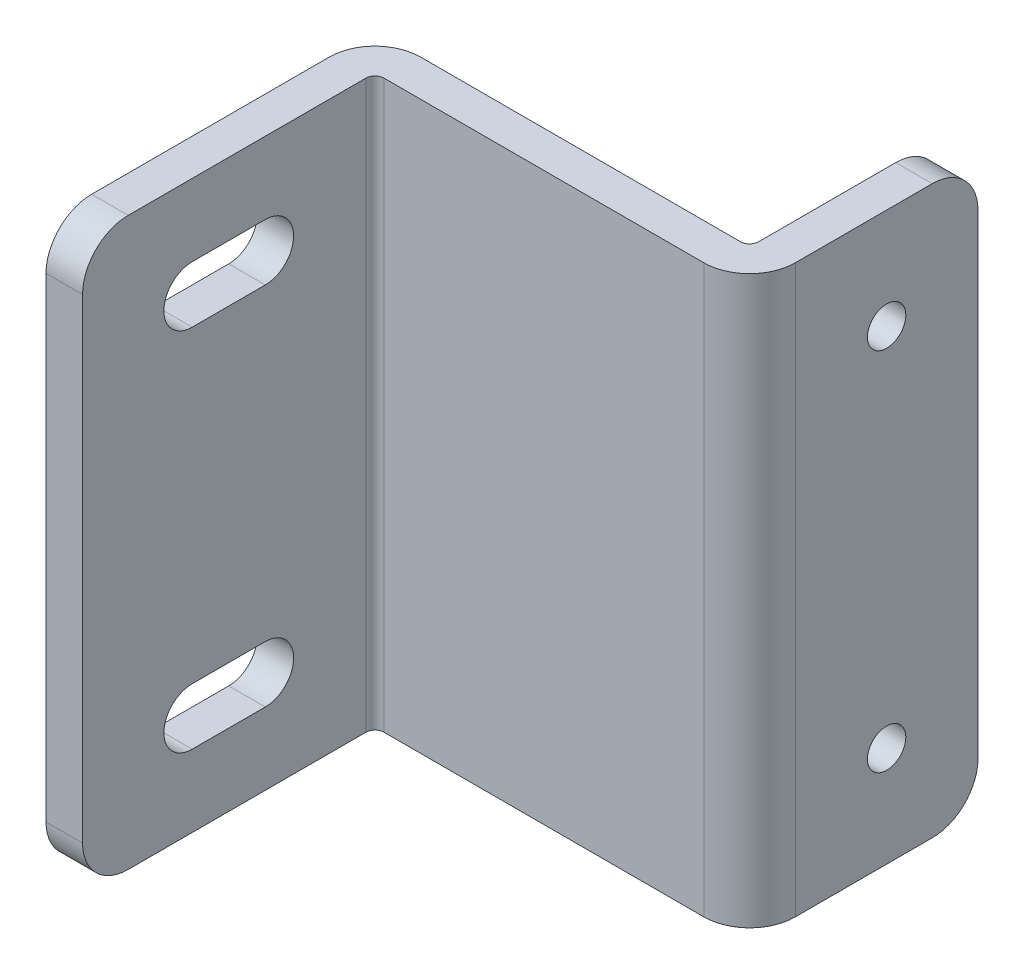
ISO-10303-21;
HEADER;
FILE_DESCRIPTION(('STEP AP214'),'2;1');
FILE_NAME('part.step','',(''),(''),'','','');
FILE_SCHEMA(('AUTOMOTIVE_DESIGN { 1 0 10303 214 1 1 1 1 }'));
ENDSEC;
DATA;
#1=APPLICATION_CONTEXT('core data for automotive mechanical design processes');
#2=APPLICATION_PROTOCOL_DEFINITION('international standard','automotive_design',2000,#1);
#3=PRODUCT_CONTEXT('',#1,'mechanical');
#4=PRODUCT('Part','Part','',(#3));
#5=PRODUCT_RELATED_PRODUCT_CATEGORY('part','',(#4));
#6=PRODUCT_DEFINITION_FORMATION('','',#4);
#7=PRODUCT_DEFINITION_CONTEXT('part definition',#1,'design');
#8=PRODUCT_DEFINITION('design','',#6,#7);
#9=PRODUCT_DEFINITION_SHAPE('','',#8);
#10=(LENGTH_UNIT() NAMED_UNIT(*) SI_UNIT(.MILLI.,.METRE.));
#11=(NAMED_UNIT(*) PLANE_ANGLE_UNIT() SI_UNIT($,.RADIAN.));
#12=(NAMED_UNIT(*) SI_UNIT($,.STERADIAN.) SOLID_ANGLE_UNIT());
#13=UNCERTAINTY_MEASURE_WITH_UNIT(LENGTH_MEASURE(1.E-05),#10,'distance_accuracy_value','');
#14=(GEOMETRIC_REPRESENTATION_CONTEXT(3) GLOBAL_UNCERTAINTY_ASSIGNED_CONTEXT((#13)) GLOBAL_UNIT_ASSIGNED_CONTEXT((#10,
#11,#12)) REPRESENTATION_CONTEXT('',''));
#15=CARTESIAN_POINT('',(0.,0.,0.));
#16=DIRECTION('',(0.,0.,1.));
#17=DIRECTION('',(1.,0.,0.));
#18=AXIS2_PLACEMENT_3D('',#15,#16,#17);
#19=CARTESIAN_POINT('',(4.00000000000007,62.,-21.));
#20=DIRECTION('',(0.,0.,1.));
#21=DIRECTION('',(1.,0.,0.));
#22=AXIS2_PLACEMENT_3D('',#19,#20,#21);
#23=PLANE('',#22);
#24=DIRECTION('',(0.,1.,0.));
#25=VECTOR('',#24,1.);
#26=CARTESIAN_POINT('',(4.00000000000007,0.,-21.));
#27=LINE('',#26,#25);
#28=CARTESIAN_POINT('',(4.00000000000007,5.,-21.));
#29=VERTEX_POINT('',#28);
#30=CARTESIAN_POINT('',(4.00000000000007,57.,-21.));
#31=VERTEX_POINT('',#30);
#32=EDGE_CURVE('E300',#29,#31,#27,.T.);
#33=ORIENTED_EDGE('',*,*,#32,.F.);
#34=DIRECTION('',(-1.,0.,0.));
#35=VECTOR('',#34,1.);
#36=CARTESIAN_POINT('',(4.00000000000007,5.,-21.));
#37=LINE('',#36,#35);
#38=CARTESIAN_POINT('',(0.,5.,-21.));
#39=VERTEX_POINT('',#38);
#40=EDGE_CURVE('E336',#39,#29,#37,.F.);
#41=ORIENTED_EDGE('',*,*,#40,.F.);
#42=DIRECTION('',(0.,1.,0.));
#43=VECTOR('',#42,1.);
#44=CARTESIAN_POINT('',(0.,0.,-21.));
#45=LINE('',#44,#43);
#46=CARTESIAN_POINT('',(0.,57.,-21.));
#47=VERTEX_POINT('',#46);
#48=EDGE_CURVE('E293',#39,#47,#45,.T.);
#49=ORIENTED_EDGE('',*,*,#48,.T.);
#50=DIRECTION('',(-1.,0.,0.));
#51=VECTOR('',#50,1.);
#52=CARTESIAN_POINT('',(4.00000000000007,57.,-21.));
#53=LINE('',#52,#51);
#54=EDGE_CURVE('E333',#31,#47,#53,.T.);
#55=ORIENTED_EDGE('',*,*,#54,.F.);
#56=EDGE_LOOP('',(#33,#41,#49,#55));
#57=FACE_BOUND('',#56,.T.);
#58=ADVANCED_FACE('F17',(#57),#23,.F.);
#59=CARTESIAN_POINT('',(-6.,11.,-11.));
#60=DIRECTION('',(1.,0.,0.));
#61=DIRECTION('',(0.,0.,-1.));
#62=AXIS2_PLACEMENT_3D('',#59,#60,#61);
#63=CYLINDRICAL_SURFACE('',#62,2.1);
#64=CARTESIAN_POINT('',(0.,11.,-11.));
#65=DIRECTION('',(1.,0.,0.));
#66=DIRECTION('',(0.,0.,-1.));
#67=AXIS2_PLACEMENT_3D('',#64,#65,#66);
#68=CIRCLE('',#67,2.1);
#69=CARTESIAN_POINT('',(0.,11.,-13.1));
#70=VERTEX_POINT('',#69);
#71=EDGE_CURVE('E366',#70,#70,#68,.F.);
#72=ORIENTED_EDGE('',*,*,#71,.T.);
#73=EDGE_LOOP('',(#72));
#74=FACE_BOUND('',#73,.T.);
#75=CARTESIAN_POINT('',(4.,11.,-11.));
#76=DIRECTION('',(1.,0.,0.));
#77=DIRECTION('',(0.,0.,-1.));
#78=AXIS2_PLACEMENT_3D('',#75,#76,#77);
#79=CIRCLE('',#78,2.1);
#80=CARTESIAN_POINT('',(4.00000000000001,11.,-13.1));
#81=VERTEX_POINT('',#80);
#82=EDGE_CURVE('E306',#81,#81,#79,.F.);
#83=ORIENTED_EDGE('',*,*,#82,.F.);
#84=EDGE_LOOP('',(#83));
#85=FACE_BOUND('',#84,.T.);
#86=ADVANCED_FACE('F502',(#74,#85),#63,.F.);
#87=CARTESIAN_POINT('',(-6.,51.,-11.));
#88=DIRECTION('',(1.,0.,0.));
#89=DIRECTION('',(0.,0.,-1.));
#90=AXIS2_PLACEMENT_3D('',#87,#88,#89);
#91=CYLINDRICAL_SURFACE('',#90,2.1);
#92=CARTESIAN_POINT('',(0.,51.,-11.));
#93=DIRECTION('',(1.,0.,0.));
#94=DIRECTION('',(0.,0.,-1.));
#95=AXIS2_PLACEMENT_3D('',#92,#93,#94);
#96=CIRCLE('',#95,2.1);
#97=CARTESIAN_POINT('',(0.,51.,-13.1));
#98=VERTEX_POINT('',#97);
#99=EDGE_CURVE('E289',#98,#98,#96,.F.);
#100=ORIENTED_EDGE('',*,*,#99,.T.);
#101=EDGE_LOOP('',(#100));
#102=FACE_BOUND('',#101,.T.);
#103=CARTESIAN_POINT('',(4.,51.,-11.));
#104=DIRECTION('',(1.,0.,0.));
#105=DIRECTION('',(0.,0.,-1.));
#106=AXIS2_PLACEMENT_3D('',#103,#104,#105);
#107=CIRCLE('',#106,2.1);
#108=CARTESIAN_POINT('',(4.00000000000001,51.,-13.1));
#109=VERTEX_POINT('',#108);
#110=EDGE_CURVE('E339',#109,#109,#107,.F.);
#111=ORIENTED_EDGE('',*,*,#110,.F.);
#112=EDGE_LOOP('',(#111));
#113=FACE_BOUND('',#112,.T.);
#114=ADVANCED_FACE('F500',(#102,#113),#91,.F.);
#115=CARTESIAN_POINT('',(-41.,62.,36.));
#116=DIRECTION('',(0.,0.,-1.));
#117=DIRECTION('',(-1.,0.,0.));
#118=AXIS2_PLACEMENT_3D('',#115,#116,#117);
#119=PLANE('',#118);
#120=DIRECTION('',(0.,1.,0.));
#121=VECTOR('',#120,1.);
#122=CARTESIAN_POINT('',(-41.,62.,36.));
#123=LINE('',#122,#121);
#124=CARTESIAN_POINT('',(-41.,5.,36.));
#125=VERTEX_POINT('',#124);
#126=CARTESIAN_POINT('',(-41.,57.,36.));
#127=VERTEX_POINT('',#126);
#128=EDGE_CURVE('E286',#125,#127,#123,.T.);
#129=ORIENTED_EDGE('',*,*,#128,.F.);
#130=DIRECTION('',(1.,0.,0.));
#131=VECTOR('',#130,1.);
#132=CARTESIAN_POINT('',(-41.,5.,36.));
#133=LINE('',#132,#131);
#134=CARTESIAN_POINT('',(-37.,5.,36.));
#135=VERTEX_POINT('',#134);
#136=EDGE_CURVE('E272',#135,#125,#133,.F.);
#137=ORIENTED_EDGE('',*,*,#136,.F.);
#138=DIRECTION('',(0.,1.,0.));
#139=VECTOR('',#138,1.);
#140=CARTESIAN_POINT('',(-37.,62.,36.));
#141=LINE('',#140,#139);
#142=CARTESIAN_POINT('',(-37.,57.,36.));
#143=VERTEX_POINT('',#142);
#144=EDGE_CURVE('E266',#135,#143,#141,.T.);
#145=ORIENTED_EDGE('',*,*,#144,.T.);
#146=DIRECTION('',(1.,0.,0.));
#147=VECTOR('',#146,1.);
#148=CARTESIAN_POINT('',(-41.,57.,36.));
#149=LINE('',#148,#147);
#150=EDGE_CURVE('E303',#127,#143,#149,.T.);
#151=ORIENTED_EDGE('',*,*,#150,.F.);
#152=EDGE_LOOP('',(#129,#137,#145,#151));
#153=FACE_BOUND('',#152,.T.);
#154=ADVANCED_FACE('F424',(#153),#119,.F.);
#155=CARTESIAN_POINT('',(-41.,14.1,16.));
#156=DIRECTION('',(0.,1.,0.));
#157=DIRECTION('',(0.,0.,1.));
#158=AXIS2_PLACEMENT_3D('',#155,#156,#157);
#159=PLANE('',#158);
#160=DIRECTION('',(0.,0.,1.));
#161=VECTOR('',#160,1.);
#162=CARTESIAN_POINT('',(-41.,14.1,4.));
#163=LINE('',#162,#161);
#164=CARTESIAN_POINT('',(-41.,14.1,16.));
#165=VERTEX_POINT('',#164);
#166=CARTESIAN_POINT('',(-41.,14.1,24.));
#167=VERTEX_POINT('',#166);
#168=EDGE_CURVE('E278',#165,#167,#163,.T.);
#169=ORIENTED_EDGE('',*,*,#168,.F.);
#170=DIRECTION('',(1.,0.,0.));
#171=VECTOR('',#170,1.);
#172=CARTESIAN_POINT('',(-41.,14.1,16.));
#173=LINE('',#172,#171);
#174=CARTESIAN_POINT('',(-37.,14.1,16.));
#175=VERTEX_POINT('',#174);
#176=EDGE_CURVE('E329',#175,#165,#173,.F.);
#177=ORIENTED_EDGE('',*,*,#176,.F.);
#178=DIRECTION('',(0.,0.,1.));
#179=VECTOR('',#178,1.);
#180=CARTESIAN_POINT('',(-37.,14.1,4.));
#181=LINE('',#180,#179);
#182=CARTESIAN_POINT('',(-37.,14.1,24.));
#183=VERTEX_POINT('',#182);
#184=EDGE_CURVE('E262',#175,#183,#181,.T.);
#185=ORIENTED_EDGE('',*,*,#184,.T.);
#186=DIRECTION('',(1.,0.,0.));
#187=VECTOR('',#186,1.);
#188=CARTESIAN_POINT('',(-41.,14.1,24.));
#189=LINE('',#188,#187);
#190=EDGE_CURVE('E327',#183,#167,#189,.F.);
#191=ORIENTED_EDGE('',*,*,#190,.T.);
#192=EDGE_LOOP('',(#169,#177,#185,#191));
#193=FACE_BOUND('',#192,.T.);
#194=ADVANCED_FACE('F479',(#193),#159,.F.);
#195=CARTESIAN_POINT('',(-41.,11.,24.));
#196=DIRECTION('',(1.,0.,0.));
#197=DIRECTION('',(0.,0.,-1.));
#198=AXIS2_PLACEMENT_3D('',#195,#196,#197);
#199=CYLINDRICAL_SURFACE('',#198,3.1);
#200=CARTESIAN_POINT('',(-41.,11.,24.));
#201=DIRECTION('',(1.,0.,0.));
#202=DIRECTION('',(0.,0.,-1.));
#203=AXIS2_PLACEMENT_3D('',#200,#201,#202);
#204=CIRCLE('',#203,3.1);
#205=CARTESIAN_POINT('',(-41.,7.9,24.));
#206=VERTEX_POINT('',#205);
#207=EDGE_CURVE('E285',#167,#206,#204,.T.);
#208=ORIENTED_EDGE('',*,*,#207,.F.);
#209=ORIENTED_EDGE('',*,*,#190,.F.);
#210=CARTESIAN_POINT('',(-37.,11.,24.));
#211=DIRECTION('',(1.,0.,0.));
#212=DIRECTION('',(0.,0.,-1.));
#213=AXIS2_PLACEMENT_3D('',#210,#211,#212);
#214=CIRCLE('',#213,3.1);
#215=CARTESIAN_POINT('',(-37.,7.9,24.));
#216=VERTEX_POINT('',#215);
#217=EDGE_CURVE('E261',#183,#216,#214,.T.);
#218=ORIENTED_EDGE('',*,*,#217,.T.);
#219=DIRECTION('',(1.,0.,0.));
#220=VECTOR('',#219,1.);
#221=CARTESIAN_POINT('',(-41.,7.9,24.));
#222=LINE('',#221,#220);
#223=EDGE_CURVE('E324',#216,#206,#222,.F.);
#224=ORIENTED_EDGE('',*,*,#223,.T.);
#225=EDGE_LOOP('',(#208,#209,#218,#224));
#226=FACE_BOUND('',#225,.T.);
#227=ADVANCED_FACE('F475',(#226),#199,.F.);
#228=CARTESIAN_POINT('',(-41.,7.9,16.));
#229=DIRECTION('',(0.,-1.,0.));
#230=DIRECTION('',(0.,0.,-1.));
#231=AXIS2_PLACEMENT_3D('',#228,#229,#230);
#232=PLANE('',#231);
#233=DIRECTION('',(0.,0.,1.));
#234=VECTOR('',#233,1.);
#235=CARTESIAN_POINT('',(-41.,7.9,4.));
#236=LINE('',#235,#234);
#237=CARTESIAN_POINT('',(-41.,7.9,16.));
#238=VERTEX_POINT('',#237);
#239=EDGE_CURVE('E282',#206,#238,#236,.F.);
#240=ORIENTED_EDGE('',*,*,#239,.F.);
#241=ORIENTED_EDGE('',*,*,#223,.F.);
#242=DIRECTION('',(0.,0.,1.));
#243=VECTOR('',#242,1.);
#244=CARTESIAN_POINT('',(-37.,7.9,4.));
#245=LINE('',#244,#243);
#246=CARTESIAN_POINT('',(-37.,7.9,16.));
#247=VERTEX_POINT('',#246);
#248=EDGE_CURVE('E258',#216,#247,#245,.F.);
#249=ORIENTED_EDGE('',*,*,#248,.T.);
#250=DIRECTION('',(1.,0.,0.));
#251=VECTOR('',#250,1.);
#252=CARTESIAN_POINT('',(-41.,7.9,16.));
#253=LINE('',#252,#251);
#254=EDGE_CURVE('E321',#247,#238,#253,.F.);
#255=ORIENTED_EDGE('',*,*,#254,.T.);
#256=EDGE_LOOP('',(#240,#241,#249,#255));
#257=FACE_BOUND('',#256,.T.);
#258=ADVANCED_FACE('F483',(#257),#232,.F.);
#259=CARTESIAN_POINT('',(-41.,11.,16.));
#260=DIRECTION('',(1.,0.,0.));
#261=DIRECTION('',(0.,0.,-1.));
#262=AXIS2_PLACEMENT_3D('',#259,#260,#261);
#263=CYLINDRICAL_SURFACE('',#262,3.1);
#264=CARTESIAN_POINT('',(-41.,11.,16.));
#265=DIRECTION('',(1.,0.,0.));
#266=DIRECTION('',(0.,0.,-1.));
#267=AXIS2_PLACEMENT_3D('',#264,#265,#266);
#268=CIRCLE('',#267,3.1);
#269=EDGE_CURVE('E281',#238,#165,#268,.T.);
#270=ORIENTED_EDGE('',*,*,#269,.F.);
#271=ORIENTED_EDGE('',*,*,#254,.F.);
#272=CARTESIAN_POINT('',(-37.,11.,16.));
#273=DIRECTION('',(1.,0.,0.));
#274=DIRECTION('',(0.,0.,-1.));
#275=AXIS2_PLACEMENT_3D('',#272,#273,#274);
#276=CIRCLE('',#275,3.1);
#277=EDGE_CURVE('E257',#247,#175,#276,.T.);
#278=ORIENTED_EDGE('',*,*,#277,.T.);
#279=ORIENTED_EDGE('',*,*,#176,.T.);
#280=EDGE_LOOP('',(#270,#271,#278,#279));
#281=FACE_BOUND('',#280,.T.);
#282=ADVANCED_FACE('F482',(#281),#263,.F.);
#283=CARTESIAN_POINT('',(-41.,54.1,16.));
#284=DIRECTION('',(0.,1.,0.));
#285=DIRECTION('',(0.,0.,1.));
#286=AXIS2_PLACEMENT_3D('',#283,#284,#285);
#287=PLANE('',#286);
#288=DIRECTION('',(0.,0.,1.));
#289=VECTOR('',#288,1.);
#290=CARTESIAN_POINT('',(-41.,54.1,4.));
#291=LINE('',#290,#289);
#292=CARTESIAN_POINT('',(-41.,54.1,16.));
#293=VERTEX_POINT('',#292);
#294=CARTESIAN_POINT('',(-41.,54.1,24.));
#295=VERTEX_POINT('',#294);
#296=EDGE_CURVE('E269',#293,#295,#291,.T.);
#297=ORIENTED_EDGE('',*,*,#296,.F.);
#298=DIRECTION('',(1.,0.,0.));
#299=VECTOR('',#298,1.);
#300=CARTESIAN_POINT('',(-41.,54.1,16.));
#301=LINE('',#300,#299);
#302=CARTESIAN_POINT('',(-37.,54.1,16.));
#303=VERTEX_POINT('',#302);
#304=EDGE_CURVE('E318',#303,#293,#301,.F.);
#305=ORIENTED_EDGE('',*,*,#304,.F.);
#306=DIRECTION('',(0.,0.,1.));
#307=VECTOR('',#306,1.);
#308=CARTESIAN_POINT('',(-37.,54.1,4.));
#309=LINE('',#308,#307);
#310=CARTESIAN_POINT('',(-37.,54.1,24.));
#311=VERTEX_POINT('',#310);
#312=EDGE_CURVE('E254',#303,#311,#309,.T.);
#313=ORIENTED_EDGE('',*,*,#312,.T.);
#314=DIRECTION('',(1.,0.,0.));
#315=VECTOR('',#314,1.);
#316=CARTESIAN_POINT('',(-41.,54.1,24.));
#317=LINE('',#316,#315);
#318=EDGE_CURVE('E316',#311,#295,#317,.F.);
#319=ORIENTED_EDGE('',*,*,#318,.T.);
#320=EDGE_LOOP('',(#297,#305,#313,#319));
#321=FACE_BOUND('',#320,.T.);
#322=ADVANCED_FACE('F491',(#321),#287,.F.);
#323=CARTESIAN_POINT('',(-41.,51.,24.));
#324=DIRECTION('',(1.,0.,0.));
#325=DIRECTION('',(0.,0.,-1.));
#326=AXIS2_PLACEMENT_3D('',#323,#324,#325);
#327=CYLINDRICAL_SURFACE('',#326,3.1);
#328=CARTESIAN_POINT('',(-41.,51.,24.));
#329=DIRECTION('',(1.,0.,0.));
#330=DIRECTION('',(0.,0.,-1.));
#331=AXIS2_PLACEMENT_3D('',#328,#329,#330);
#332=CIRCLE('',#331,3.1);
#333=CARTESIAN_POINT('',(-41.,47.9,24.));
#334=VERTEX_POINT('',#333);
#335=EDGE_CURVE('E277',#295,#334,#332,.T.);
#336=ORIENTED_EDGE('',*,*,#335,.F.);
#337=ORIENTED_EDGE('',*,*,#318,.F.);
#338=CARTESIAN_POINT('',(-37.,51.,24.));
#339=DIRECTION('',(1.,0.,0.));
#340=DIRECTION('',(0.,0.,-1.));
#341=AXIS2_PLACEMENT_3D('',#338,#339,#340);
#342=CIRCLE('',#341,3.1);
#343=CARTESIAN_POINT('',(-37.,47.9,24.));
#344=VERTEX_POINT('',#343);
#345=EDGE_CURVE('E253',#311,#344,#342,.T.);
#346=ORIENTED_EDGE('',*,*,#345,.T.);
#347=DIRECTION('',(1.,0.,0.));
#348=VECTOR('',#347,1.);
#349=CARTESIAN_POINT('',(-41.,47.9,24.));
#350=LINE('',#349,#348);
#351=EDGE_CURVE('E313',#344,#334,#350,.F.);
#352=ORIENTED_EDGE('',*,*,#351,.T.);
#353=EDGE_LOOP('',(#336,#337,#346,#352));
#354=FACE_BOUND('',#353,.T.);
#355=ADVANCED_FACE('F540',(#354),#327,.F.);
#356=CARTESIAN_POINT('',(-41.,47.9,16.));
#357=DIRECTION('',(0.,-1.,0.));
#358=DIRECTION('',(0.,0.,-1.));
#359=AXIS2_PLACEMENT_3D('',#356,#357,#358);
#360=PLANE('',#359);
#361=DIRECTION('',(0.,0.,1.));
#362=VECTOR('',#361,1.);
#363=CARTESIAN_POINT('',(-41.,47.9,4.));
#364=LINE('',#363,#362);
#365=CARTESIAN_POINT('',(-41.,47.9,16.));
#366=VERTEX_POINT('',#365);
#367=EDGE_CURVE('E274',#334,#366,#364,.F.);
#368=ORIENTED_EDGE('',*,*,#367,.F.);
#369=ORIENTED_EDGE('',*,*,#351,.F.);
#370=DIRECTION('',(0.,0.,1.));
#371=VECTOR('',#370,1.);
#372=CARTESIAN_POINT('',(-37.,47.9,4.));
#373=LINE('',#372,#371);
#374=CARTESIAN_POINT('',(-37.,47.9,16.));
#375=VERTEX_POINT('',#374);
#376=EDGE_CURVE('E250',#344,#375,#373,.F.);
#377=ORIENTED_EDGE('',*,*,#376,.T.);
#378=DIRECTION('',(1.,0.,0.));
#379=VECTOR('',#378,1.);
#380=CARTESIAN_POINT('',(-41.,47.9,16.));
#381=LINE('',#380,#379);
#382=EDGE_CURVE('E187',#375,#366,#381,.F.);
#383=ORIENTED_EDGE('',*,*,#382,.T.);
#384=EDGE_LOOP('',(#368,#369,#377,#383));
#385=FACE_BOUND('',#384,.T.);
#386=ADVANCED_FACE('F536',(#385),#360,.F.);
#387=CARTESIAN_POINT('',(-41.,51.,16.));
#388=DIRECTION('',(1.,0.,0.));
#389=DIRECTION('',(0.,0.,-1.));
#390=AXIS2_PLACEMENT_3D('',#387,#388,#389);
#391=CYLINDRICAL_SURFACE('',#390,3.1);
#392=CARTESIAN_POINT('',(-41.,51.,16.));
#393=DIRECTION('',(1.,0.,0.));
#394=DIRECTION('',(0.,0.,-1.));
#395=AXIS2_PLACEMENT_3D('',#392,#393,#394);
#396=CIRCLE('',#395,3.1);
#397=EDGE_CURVE('E273',#366,#293,#396,.T.);
#398=ORIENTED_EDGE('',*,*,#397,.F.);
#399=ORIENTED_EDGE('',*,*,#382,.F.);
#400=CARTESIAN_POINT('',(-37.,51.,16.));
#401=DIRECTION('',(1.,0.,0.));
#402=DIRECTION('',(0.,0.,-1.));
#403=AXIS2_PLACEMENT_3D('',#400,#401,#402);
#404=CIRCLE('',#403,3.1);
#405=EDGE_CURVE('E247',#375,#303,#404,.T.);
#406=ORIENTED_EDGE('',*,*,#405,.T.);
#407=ORIENTED_EDGE('',*,*,#304,.T.);
#408=EDGE_LOOP('',(#398,#399,#406,#407));
#409=FACE_BOUND('',#408,.T.);
#410=ADVANCED_FACE('F533',(#409),#391,.F.);
#411=CARTESIAN_POINT('',(-36.,0.,5.));
#412=DIRECTION('',(0.,-1.,0.));
#413=DIRECTION('',(0.,0.,-1.));
#414=AXIS2_PLACEMENT_3D('',#411,#412,#413);
#415=CYLINDRICAL_SURFACE('',#414,1.);
#416=DIRECTION('',(0.,1.,0.));
#417=VECTOR('',#416,1.);
#418=CARTESIAN_POINT('',(-37.,62.,5.));
#419=LINE('',#418,#417);
#420=CARTESIAN_POINT('',(-37.,62.,5.));
#421=VERTEX_POINT('',#420);
#422=CARTESIAN_POINT('',(-37.,0.,5.));
#423=VERTEX_POINT('',#422);
#424=EDGE_CURVE('E189',#421,#423,#419,.F.);
#425=ORIENTED_EDGE('',*,*,#424,.T.);
#426=CARTESIAN_POINT('',(-36.,0.,5.));
#427=DIRECTION('',(0.,-1.,0.));
#428=DIRECTION('',(0.,0.,-1.));
#429=AXIS2_PLACEMENT_3D('',#426,#427,#428);
#430=CIRCLE('',#429,1.);
#431=CARTESIAN_POINT('',(-36.,0.,4.));
#432=VERTEX_POINT('',#431);
#433=EDGE_CURVE('E20',#432,#423,#430,.F.);
#434=ORIENTED_EDGE('',*,*,#433,.F.);
#435=DIRECTION('',(0.,1.,0.));
#436=VECTOR('',#435,1.);
#437=CARTESIAN_POINT('',(-36.,0.,4.));
#438=LINE('',#437,#436);
#439=CARTESIAN_POINT('',(-36.,62.,4.));
#440=VERTEX_POINT('',#439);
#441=EDGE_CURVE('E244',#440,#432,#438,.F.);
#442=ORIENTED_EDGE('',*,*,#441,.F.);
#443=CARTESIAN_POINT('',(-36.,62.,5.));
#444=DIRECTION('',(0.,-1.,0.));
#445=DIRECTION('',(0.,0.,-1.));
#446=AXIS2_PLACEMENT_3D('',#443,#444,#445);
#447=CIRCLE('',#446,1.);
#448=EDGE_CURVE('E186',#421,#440,#447,.T.);
#449=ORIENTED_EDGE('',*,*,#448,.F.);
#450=EDGE_LOOP('',(#425,#434,#442,#449));
#451=FACE_BOUND('',#450,.T.);
#452=ADVANCED_FACE('F190',(#451),#415,.F.);
#453=CARTESIAN_POINT('',(4.00000000000006,57.,-16.));
#454=DIRECTION('',(-1.,0.,0.));
#455=DIRECTION('',(0.,0.,1.));
#456=AXIS2_PLACEMENT_3D('',#453,#454,#455);
#457=CYLINDRICAL_SURFACE('',#456,5.);
#458=CARTESIAN_POINT('',(4.00000000000006,57.,-16.));
#459=DIRECTION('',(-1.,0.,0.));
#460=DIRECTION('',(0.,0.,1.));
#461=AXIS2_PLACEMENT_3D('',#458,#459,#460);
#462=CIRCLE('',#461,5.);
#463=CARTESIAN_POINT('',(4.00000000000006,62.,-16.));
#464=VERTEX_POINT('',#463);
#465=EDGE_CURVE('E302',#31,#464,#462,.F.);
#466=ORIENTED_EDGE('',*,*,#465,.F.);
#467=ORIENTED_EDGE('',*,*,#54,.T.);
#468=CARTESIAN_POINT('',(0.,57.,-16.));
#469=DIRECTION('',(-1.,0.,0.));
#470=DIRECTION('',(0.,0.,1.));
#471=AXIS2_PLACEMENT_3D('',#468,#469,#470);
#472=CIRCLE('',#471,5.);
#473=CARTESIAN_POINT('',(0.,62.,-16.));
#474=VERTEX_POINT('',#473);
#475=EDGE_CURVE('E296',#47,#474,#472,.F.);
#476=ORIENTED_EDGE('',*,*,#475,.T.);
#477=DIRECTION('',(1.,0.,0.));
#478=VECTOR('',#477,1.);
#479=CARTESIAN_POINT('',(0.,62.,-16.));
#480=LINE('',#479,#478);
#481=EDGE_CURVE('E239',#474,#464,#480,.T.);
#482=ORIENTED_EDGE('',*,*,#481,.T.);
#483=EDGE_LOOP('',(#466,#467,#476,#482));
#484=FACE_BOUND('',#483,.T.);
#485=ADVANCED_FACE('F398',(#484),#457,.T.);
#486=CARTESIAN_POINT('',(-41.,57.,31.));
#487=DIRECTION('',(1.,0.,0.));
#488=DIRECTION('',(0.,0.,-1.));
#489=AXIS2_PLACEMENT_3D('',#486,#487,#488);
#490=CYLINDRICAL_SURFACE('',#489,5.);
#491=CARTESIAN_POINT('',(-41.,57.,31.));
#492=DIRECTION('',(1.,0.,0.));
#493=DIRECTION('',(0.,0.,-1.));
#494=AXIS2_PLACEMENT_3D('',#491,#492,#493);
#495=CIRCLE('',#494,5.);
#496=CARTESIAN_POINT('',(-41.,62.,31.));
#497=VERTEX_POINT('',#496);
#498=EDGE_CURVE('E288',#127,#497,#495,.F.);
#499=ORIENTED_EDGE('',*,*,#498,.F.);
#500=ORIENTED_EDGE('',*,*,#150,.T.);
#501=CARTESIAN_POINT('',(-37.,57.,31.));
#502=DIRECTION('',(1.,0.,0.));
#503=DIRECTION('',(0.,0.,-1.));
#504=AXIS2_PLACEMENT_3D('',#501,#502,#503);
#505=CIRCLE('',#504,5.);
#506=CARTESIAN_POINT('',(-37.,62.,31.));
#507=VERTEX_POINT('',#506);
#508=EDGE_CURVE('E265',#143,#507,#505,.F.);
#509=ORIENTED_EDGE('',*,*,#508,.T.);
#510=DIRECTION('',(1.,0.,0.));
#511=VECTOR('',#510,1.);
#512=CARTESIAN_POINT('',(0.,62.,31.));
#513=LINE('',#512,#511);
#514=EDGE_CURVE('E229',#507,#497,#513,.F.);
#515=ORIENTED_EDGE('',*,*,#514,.T.);
#516=EDGE_LOOP('',(#499,#500,#509,#515));
#517=FACE_BOUND('',#516,.T.);
#518=ADVANCED_FACE('F419',(#517),#490,.T.);
#519=CARTESIAN_POINT('',(-1.,0.,-1.));
#520=DIRECTION('',(0.,-1.,0.));
#521=DIRECTION('',(0.,0.,-1.));
#522=AXIS2_PLACEMENT_3D('',#519,#520,#521);
#523=CYLINDRICAL_SURFACE('',#522,5.);
#524=DIRECTION('',(0.,1.,0.));
#525=VECTOR('',#524,1.);
#526=CARTESIAN_POINT('',(-1.,0.,4.));
#527=LINE('',#526,#525);
#528=CARTESIAN_POINT('',(-1.,0.,4.));
#529=VERTEX_POINT('',#528);
#530=CARTESIAN_POINT('',(-1.,62.,4.));
#531=VERTEX_POINT('',#530);
#532=EDGE_CURVE('E246',#529,#531,#527,.T.);
#533=ORIENTED_EDGE('',*,*,#532,.F.);
#534=CARTESIAN_POINT('',(-1.,0.,-1.));
#535=DIRECTION('',(0.,-1.,0.));
#536=DIRECTION('',(0.,0.,-1.));
#537=AXIS2_PLACEMENT_3D('',#534,#535,#536);
#538=CIRCLE('',#537,5.);
#539=CARTESIAN_POINT('',(4.,0.,-1.));
#540=VERTEX_POINT('',#539);
#541=EDGE_CURVE('E217',#529,#540,#538,.F.);
#542=ORIENTED_EDGE('',*,*,#541,.T.);
#543=DIRECTION('',(0.,1.,0.));
#544=VECTOR('',#543,1.);
#545=CARTESIAN_POINT('',(4.,0.,-0.999999999999986));
#546=LINE('',#545,#544);
#547=CARTESIAN_POINT('',(4.,62.,-1.));
#548=VERTEX_POINT('',#547);
#549=EDGE_CURVE('E304',#548,#540,#546,.F.);
#550=ORIENTED_EDGE('',*,*,#549,.F.);
#551=CARTESIAN_POINT('',(-1.,62.,-1.));
#552=DIRECTION('',(0.,-1.,0.));
#553=DIRECTION('',(0.,0.,-1.));
#554=AXIS2_PLACEMENT_3D('',#551,#552,#553);
#555=CIRCLE('',#554,5.);
#556=EDGE_CURVE('E235',#548,#531,#555,.T.);
#557=ORIENTED_EDGE('',*,*,#556,.T.);
#558=EDGE_LOOP('',(#533,#542,#550,#557));
#559=FACE_BOUND('',#558,.T.);
#560=ADVANCED_FACE('F387',(#559),#523,.T.);
#561=CARTESIAN_POINT('',(4.,0.,0.));
#562=DIRECTION('',(1.,0.,0.));
#563=DIRECTION('',(0.,0.,-1.));
#564=AXIS2_PLACEMENT_3D('',#561,#562,#563);
#565=PLANE('',#564);
#566=ORIENTED_EDGE('',*,*,#110,.T.);
#567=EDGE_LOOP('',(#566));
#568=FACE_BOUND('',#567,.T.);
#569=ORIENTED_EDGE('',*,*,#82,.T.);
#570=EDGE_LOOP('',(#569));
#571=FACE_BOUND('',#570,.T.);
#572=DIRECTION('',(0.,0.,1.));
#573=VECTOR('',#572,1.);
#574=CARTESIAN_POINT('',(4.00000000000006,62.,4.));
#575=LINE('',#574,#573);
#576=EDGE_CURVE('E236',#464,#548,#575,.T.);
#577=ORIENTED_EDGE('',*,*,#576,.T.);
#578=ORIENTED_EDGE('',*,*,#549,.T.);
#579=DIRECTION('',(0.,0.,1.));
#580=VECTOR('',#579,1.);
#581=CARTESIAN_POINT('',(4.,0.,4.));
#582=LINE('',#581,#580);
#583=CARTESIAN_POINT('',(4.,0.,-16.));
#584=VERTEX_POINT('',#583);
#585=EDGE_CURVE('E214',#540,#584,#582,.F.);
#586=ORIENTED_EDGE('',*,*,#585,.T.);
#587=CARTESIAN_POINT('',(4.00000000000006,5.,-16.));
#588=DIRECTION('',(-1.,0.,0.));
#589=DIRECTION('',(0.,0.,1.));
#590=AXIS2_PLACEMENT_3D('',#587,#588,#589);
#591=CIRCLE('',#590,5.);
#592=EDGE_CURVE('E338',#29,#584,#591,.T.);
#593=ORIENTED_EDGE('',*,*,#592,.F.);
#594=ORIENTED_EDGE('',*,*,#32,.T.);
#595=ORIENTED_EDGE('',*,*,#465,.T.);
#596=EDGE_LOOP('',(#577,#578,#586,#593,#594,#595));
#597=FACE_BOUND('',#596,.T.);
#598=ADVANCED_FACE('F391',(#568,#571,#597),#565,.T.);
#599=CARTESIAN_POINT('',(4.00000000000006,5.,-16.));
#600=DIRECTION('',(-1.,0.,0.));
#601=DIRECTION('',(0.,0.,1.));
#602=AXIS2_PLACEMENT_3D('',#599,#600,#601);
#603=CYLINDRICAL_SURFACE('',#602,5.);
#604=ORIENTED_EDGE('',*,*,#592,.T.);
#605=DIRECTION('',(-1.,0.,0.));
#606=VECTOR('',#605,1.);
#607=CARTESIAN_POINT('',(0.,0.,-16.));
#608=LINE('',#607,#606);
#609=CARTESIAN_POINT('',(0.,0.,-16.));
#610=VERTEX_POINT('',#609);
#611=EDGE_CURVE('E213',#584,#610,#608,.T.);
#612=ORIENTED_EDGE('',*,*,#611,.T.);
#613=CARTESIAN_POINT('',(0.,5.,-16.));
#614=DIRECTION('',(-1.,0.,0.));
#615=DIRECTION('',(0.,0.,1.));
#616=AXIS2_PLACEMENT_3D('',#613,#614,#615);
#617=CIRCLE('',#616,5.);
#618=EDGE_CURVE('E297',#610,#39,#617,.F.);
#619=ORIENTED_EDGE('',*,*,#618,.T.);
#620=ORIENTED_EDGE('',*,*,#40,.T.);
#621=EDGE_LOOP('',(#604,#612,#619,#620));
#622=FACE_BOUND('',#621,.T.);
#623=ADVANCED_FACE('F439',(#622),#603,.T.);
#624=CARTESIAN_POINT('',(0.,0.,0.));
#625=DIRECTION('',(1.,0.,0.));
#626=DIRECTION('',(0.,0.,-1.));
#627=AXIS2_PLACEMENT_3D('',#624,#625,#626);
#628=PLANE('',#627);
#629=ORIENTED_EDGE('',*,*,#99,.F.);
#630=EDGE_LOOP('',(#629));
#631=FACE_BOUND('',#630,.T.);
#632=ORIENTED_EDGE('',*,*,#71,.F.);
#633=EDGE_LOOP('',(#632));
#634=FACE_BOUND('',#633,.T.);
#635=ORIENTED_EDGE('',*,*,#48,.F.);
#636=ORIENTED_EDGE('',*,*,#618,.F.);
#637=DIRECTION('',(0.,0.,1.));
#638=VECTOR('',#637,1.);
#639=CARTESIAN_POINT('',(0.,0.,4.));
#640=LINE('',#639,#638);
#641=CARTESIAN_POINT('',(0.,0.,-1.));
#642=VERTEX_POINT('',#641);
#643=EDGE_CURVE('E209',#610,#642,#640,.T.);
#644=ORIENTED_EDGE('',*,*,#643,.T.);
#645=DIRECTION('',(0.,-1.,0.));
#646=VECTOR('',#645,1.);
#647=CARTESIAN_POINT('',(0.,0.,-1.));
#648=LINE('',#647,#646);
#649=CARTESIAN_POINT('',(0.,62.,-1.));
#650=VERTEX_POINT('',#649);
#651=EDGE_CURVE('E249',#642,#650,#648,.F.);
#652=ORIENTED_EDGE('',*,*,#651,.T.);
#653=DIRECTION('',(0.,0.,1.));
#654=VECTOR('',#653,1.);
#655=CARTESIAN_POINT('',(0.,62.,4.));
#656=LINE('',#655,#654);
#657=EDGE_CURVE('E240',#650,#474,#656,.F.);
#658=ORIENTED_EDGE('',*,*,#657,.T.);
#659=ORIENTED_EDGE('',*,*,#475,.F.);
#660=EDGE_LOOP('',(#635,#636,#644,#652,#658,#659));
#661=FACE_BOUND('',#660,.T.);
#662=ADVANCED_FACE('F403',(#631,#634,#661),#628,.F.);
#663=CARTESIAN_POINT('',(-41.,62.,4.));
#664=DIRECTION('',(-1.,0.,0.));
#665=DIRECTION('',(0.,0.,1.));
#666=AXIS2_PLACEMENT_3D('',#663,#664,#665);
#667=PLANE('',#666);
#668=ORIENTED_EDGE('',*,*,#397,.T.);
#669=ORIENTED_EDGE('',*,*,#296,.T.);
#670=ORIENTED_EDGE('',*,*,#335,.T.);
#671=ORIENTED_EDGE('',*,*,#367,.T.);
#672=EDGE_LOOP('',(#668,#669,#670,#671));
#673=FACE_BOUND('',#672,.T.);
#674=ORIENTED_EDGE('',*,*,#269,.T.);
#675=ORIENTED_EDGE('',*,*,#168,.T.);
#676=ORIENTED_EDGE('',*,*,#207,.T.);
#677=ORIENTED_EDGE('',*,*,#239,.T.);
#678=EDGE_LOOP('',(#674,#675,#676,#677));
#679=FACE_BOUND('',#678,.T.);
#680=DIRECTION('',(0.,0.,1.));
#681=VECTOR('',#680,1.);
#682=CARTESIAN_POINT('',(-41.,62.,4.));
#683=LINE('',#682,#681);
#684=CARTESIAN_POINT('',(-41.,62.,5.));
#685=VERTEX_POINT('',#684);
#686=EDGE_CURVE('E225',#497,#685,#683,.F.);
#687=ORIENTED_EDGE('',*,*,#686,.T.);
#688=DIRECTION('',(0.,-1.,0.));
#689=VECTOR('',#688,1.);
#690=CARTESIAN_POINT('',(-41.,0.,5.));
#691=LINE('',#690,#689);
#692=CARTESIAN_POINT('',(-41.,0.,5.));
#693=VERTEX_POINT('',#692);
#694=EDGE_CURVE('E228',#693,#685,#691,.F.);
#695=ORIENTED_EDGE('',*,*,#694,.F.);
#696=DIRECTION('',(0.,0.,1.));
#697=VECTOR('',#696,1.);
#698=CARTESIAN_POINT('',(-41.,0.,4.));
#699=LINE('',#698,#697);
#700=CARTESIAN_POINT('',(-41.,0.,31.));
#701=VERTEX_POINT('',#700);
#702=EDGE_CURVE('E204',#693,#701,#699,.T.);
#703=ORIENTED_EDGE('',*,*,#702,.T.);
#704=CARTESIAN_POINT('',(-41.,5.,31.));
#705=DIRECTION('',(1.,0.,0.));
#706=DIRECTION('',(0.,0.,-1.));
#707=AXIS2_PLACEMENT_3D('',#704,#705,#706);
#708=CIRCLE('',#707,5.);
#709=EDGE_CURVE('E195',#125,#701,#708,.T.);
#710=ORIENTED_EDGE('',*,*,#709,.F.);
#711=ORIENTED_EDGE('',*,*,#128,.T.);
#712=ORIENTED_EDGE('',*,*,#498,.T.);
#713=EDGE_LOOP('',(#687,#695,#703,#710,#711,#712));
#714=FACE_BOUND('',#713,.T.);
#715=ADVANCED_FACE('F428',(#673,#679,#714),#667,.T.);
#716=CARTESIAN_POINT('',(-41.,5.,31.));
#717=DIRECTION('',(1.,0.,0.));
#718=DIRECTION('',(0.,0.,-1.));
#719=AXIS2_PLACEMENT_3D('',#716,#717,#718);
#720=CYLINDRICAL_SURFACE('',#719,5.);
#721=ORIENTED_EDGE('',*,*,#709,.T.);
#722=DIRECTION('',(-1.,0.,0.));
#723=VECTOR('',#722,1.);
#724=CARTESIAN_POINT('',(0.,0.,31.));
#725=LINE('',#724,#723);
#726=CARTESIAN_POINT('',(-37.,0.,31.));
#727=VERTEX_POINT('',#726);
#728=EDGE_CURVE('E200',#701,#727,#725,.F.);
#729=ORIENTED_EDGE('',*,*,#728,.T.);
#730=CARTESIAN_POINT('',(-37.,5.,31.));
#731=DIRECTION('',(1.,0.,0.));
#732=DIRECTION('',(0.,0.,-1.));
#733=AXIS2_PLACEMENT_3D('',#730,#731,#732);
#734=CIRCLE('',#733,5.);
#735=EDGE_CURVE('E194',#727,#135,#734,.F.);
#736=ORIENTED_EDGE('',*,*,#735,.T.);
#737=ORIENTED_EDGE('',*,*,#136,.T.);
#738=EDGE_LOOP('',(#721,#729,#736,#737));
#739=FACE_BOUND('',#738,.T.);
#740=ADVANCED_FACE('F427',(#739),#720,.T.);
#741=CARTESIAN_POINT('',(-37.,62.,4.));
#742=DIRECTION('',(-1.,0.,0.));
#743=DIRECTION('',(0.,0.,1.));
#744=AXIS2_PLACEMENT_3D('',#741,#742,#743);
#745=PLANE('',#744);
#746=ORIENTED_EDGE('',*,*,#376,.F.);
#747=ORIENTED_EDGE('',*,*,#345,.F.);
#748=ORIENTED_EDGE('',*,*,#312,.F.);
#749=ORIENTED_EDGE('',*,*,#405,.F.);
#750=EDGE_LOOP('',(#746,#747,#748,#749));
#751=FACE_BOUND('',#750,.T.);
#752=ORIENTED_EDGE('',*,*,#248,.F.);
#753=ORIENTED_EDGE('',*,*,#217,.F.);
#754=ORIENTED_EDGE('',*,*,#184,.F.);
#755=ORIENTED_EDGE('',*,*,#277,.F.);
#756=EDGE_LOOP('',(#752,#753,#754,#755));
#757=FACE_BOUND('',#756,.T.);
#758=ORIENTED_EDGE('',*,*,#144,.F.);
#759=ORIENTED_EDGE('',*,*,#735,.F.);
#760=DIRECTION('',(0.,0.,1.));
#761=VECTOR('',#760,1.);
#762=CARTESIAN_POINT('',(-37.,0.,4.));
#763=LINE('',#762,#761);
#764=EDGE_CURVE('E182',#727,#423,#763,.F.);
#765=ORIENTED_EDGE('',*,*,#764,.T.);
#766=ORIENTED_EDGE('',*,*,#424,.F.);
#767=DIRECTION('',(0.,0.,1.));
#768=VECTOR('',#767,1.);
#769=CARTESIAN_POINT('',(-37.,62.,4.));
#770=LINE('',#769,#768);
#771=EDGE_CURVE('E230',#421,#507,#770,.T.);
#772=ORIENTED_EDGE('',*,*,#771,.T.);
#773=ORIENTED_EDGE('',*,*,#508,.F.);
#774=EDGE_LOOP('',(#758,#759,#765,#766,#772,#773));
#775=FACE_BOUND('',#774,.T.);
#776=ADVANCED_FACE('F198',(#751,#757,#775),#745,.F.);
#777=CARTESIAN_POINT('',(0.,0.,4.));
#778=DIRECTION('',(0.,0.,1.));
#779=DIRECTION('',(1.,0.,0.));
#780=AXIS2_PLACEMENT_3D('',#777,#778,#779);
#781=PLANE('',#780);
#782=DIRECTION('',(-1.,0.,0.));
#783=VECTOR('',#782,1.);
#784=CARTESIAN_POINT('',(0.,0.,4.));
#785=LINE('',#784,#783);
#786=EDGE_CURVE('E185',#432,#529,#785,.F.);
#787=ORIENTED_EDGE('',*,*,#786,.T.);
#788=ORIENTED_EDGE('',*,*,#532,.T.);
#789=DIRECTION('',(1.,0.,0.));
#790=VECTOR('',#789,1.);
#791=CARTESIAN_POINT('',(0.,62.,4.));
#792=LINE('',#791,#790);
#793=EDGE_CURVE('E232',#531,#440,#792,.F.);
#794=ORIENTED_EDGE('',*,*,#793,.T.);
#795=ORIENTED_EDGE('',*,*,#441,.T.);
#796=EDGE_LOOP('',(#787,#788,#794,#795));
#797=FACE_BOUND('',#796,.T.);
#798=ADVANCED_FACE('F384',(#797),#781,.T.);
#799=CARTESIAN_POINT('',(-1.,0.,-1.));
#800=DIRECTION('',(0.,-1.,0.));
#801=DIRECTION('',(0.,0.,-1.));
#802=AXIS2_PLACEMENT_3D('',#799,#800,#801);
#803=CYLINDRICAL_SURFACE('',#802,1.);
#804=ORIENTED_EDGE('',*,*,#651,.F.);
#805=CARTESIAN_POINT('',(-1.,0.,-1.));
#806=DIRECTION('',(0.,-1.,0.));
#807=DIRECTION('',(0.,0.,-1.));
#808=AXIS2_PLACEMENT_3D('',#805,#806,#807);
#809=CIRCLE('',#808,1.);
#810=CARTESIAN_POINT('',(-1.,0.,0.));
#811=VERTEX_POINT('',#810);
#812=EDGE_CURVE('E212',#642,#811,#809,.T.);
#813=ORIENTED_EDGE('',*,*,#812,.T.);
#814=DIRECTION('',(0.,1.,0.));
#815=VECTOR('',#814,1.);
#816=CARTESIAN_POINT('',(-1.,0.,0.));
#817=LINE('',#816,#815);
#818=CARTESIAN_POINT('',(-1.,62.,0.));
#819=VERTEX_POINT('',#818);
#820=EDGE_CURVE('E202',#811,#819,#817,.T.);
#821=ORIENTED_EDGE('',*,*,#820,.T.);
#822=CARTESIAN_POINT('',(-1.,62.,-1.));
#823=DIRECTION('',(0.,-1.,0.));
#824=DIRECTION('',(0.,0.,-1.));
#825=AXIS2_PLACEMENT_3D('',#822,#823,#824);
#826=CIRCLE('',#825,1.);
#827=EDGE_CURVE('E243',#819,#650,#826,.F.);
#828=ORIENTED_EDGE('',*,*,#827,.T.);
#829=EDGE_LOOP('',(#804,#813,#821,#828));
#830=FACE_BOUND('',#829,.T.);
#831=ADVANCED_FACE('F407',(#830),#803,.F.);
#832=CARTESIAN_POINT('',(0.,62.,4.));
#833=DIRECTION('',(0.,-1.,0.));
#834=DIRECTION('',(1.,0.,0.));
#835=AXIS2_PLACEMENT_3D('',#832,#833,#834);
#836=PLANE('',#835);
#837=CARTESIAN_POINT('',(-36.,62.,5.));
#838=DIRECTION('',(0.,-1.,0.));
#839=DIRECTION('',(0.,0.,-1.));
#840=AXIS2_PLACEMENT_3D('',#837,#838,#839);
#841=CIRCLE('',#840,5.);
#842=CARTESIAN_POINT('',(-36.,62.,0.));
#843=VERTEX_POINT('',#842);
#844=EDGE_CURVE('E291',#685,#843,#841,.T.);
#845=ORIENTED_EDGE('',*,*,#844,.F.);
#846=ORIENTED_EDGE('',*,*,#686,.F.);
#847=ORIENTED_EDGE('',*,*,#514,.F.);
#848=ORIENTED_EDGE('',*,*,#771,.F.);
#849=ORIENTED_EDGE('',*,*,#448,.T.);
#850=ORIENTED_EDGE('',*,*,#793,.F.);
#851=ORIENTED_EDGE('',*,*,#556,.F.);
#852=ORIENTED_EDGE('',*,*,#576,.F.);
#853=ORIENTED_EDGE('',*,*,#481,.F.);
#854=ORIENTED_EDGE('',*,*,#657,.F.);
#855=ORIENTED_EDGE('',*,*,#827,.F.);
#856=DIRECTION('',(1.,0.,0.));
#857=VECTOR('',#856,1.);
#858=CARTESIAN_POINT('',(0.,62.,0.));
#859=LINE('',#858,#857);
#860=EDGE_CURVE('E219',#819,#843,#859,.F.);
#861=ORIENTED_EDGE('',*,*,#860,.T.);
#862=EDGE_LOOP('',(#845,#846,#847,#848,#849,#850,#851,#852,#853,#854,#855,#861));
#863=FACE_BOUND('',#862,.T.);
#864=ADVANCED_FACE('F380',(#863),#836,.F.);
#865=CARTESIAN_POINT('',(-36.,0.,5.));
#866=DIRECTION('',(0.,-1.,0.));
#867=DIRECTION('',(0.,0.,-1.));
#868=AXIS2_PLACEMENT_3D('',#865,#866,#867);
#869=CYLINDRICAL_SURFACE('',#868,5.);
#870=DIRECTION('',(0.,1.,0.));
#871=VECTOR('',#870,1.);
#872=CARTESIAN_POINT('',(-36.,0.,0.));
#873=LINE('',#872,#871);
#874=CARTESIAN_POINT('',(-36.,0.,0.));
#875=VERTEX_POINT('',#874);
#876=EDGE_CURVE('E26',#843,#875,#873,.F.);
#877=ORIENTED_EDGE('',*,*,#876,.T.);
#878=CARTESIAN_POINT('',(-36.,0.,5.));
#879=DIRECTION('',(0.,-1.,0.));
#880=DIRECTION('',(0.,0.,-1.));
#881=AXIS2_PLACEMENT_3D('',#878,#879,#880);
#882=CIRCLE('',#881,5.);
#883=EDGE_CURVE('E34',#875,#693,#882,.F.);
#884=ORIENTED_EDGE('',*,*,#883,.T.);
#885=ORIENTED_EDGE('',*,*,#694,.T.);
#886=ORIENTED_EDGE('',*,*,#844,.T.);
#887=EDGE_LOOP('',(#877,#884,#885,#886));
#888=FACE_BOUND('',#887,.T.);
#889=ADVANCED_FACE('F414',(#888),#869,.T.);
#890=CARTESIAN_POINT('',(0.,0.,4.));
#891=DIRECTION('',(0.,1.,0.));
#892=DIRECTION('',(-1.,0.,0.));
#893=AXIS2_PLACEMENT_3D('',#890,#891,#892);
#894=PLANE('',#893);
#895=ORIENTED_EDGE('',*,*,#433,.T.);
#896=ORIENTED_EDGE('',*,*,#764,.F.);
#897=ORIENTED_EDGE('',*,*,#728,.F.);
#898=ORIENTED_EDGE('',*,*,#702,.F.);
#899=ORIENTED_EDGE('',*,*,#883,.F.);
#900=DIRECTION('',(1.,0.,0.));
#901=VECTOR('',#900,1.);
#902=CARTESIAN_POINT('',(0.,0.,0.));
#903=LINE('',#902,#901);
#904=EDGE_CURVE('E11',#875,#811,#903,.T.);
#905=ORIENTED_EDGE('',*,*,#904,.T.);
#906=ORIENTED_EDGE('',*,*,#812,.F.);
#907=ORIENTED_EDGE('',*,*,#643,.F.);
#908=ORIENTED_EDGE('',*,*,#611,.F.);
#909=ORIENTED_EDGE('',*,*,#585,.F.);
#910=ORIENTED_EDGE('',*,*,#541,.F.);
#911=ORIENTED_EDGE('',*,*,#786,.F.);
#912=EDGE_LOOP('',(#895,#896,#897,#898,#899,#905,#906,#907,#908,#909,#910,#911));
#913=FACE_BOUND('',#912,.T.);
#914=ADVANCED_FACE('F179',(#913),#894,.F.);
#915=CARTESIAN_POINT('',(0.,0.,0.));
#916=DIRECTION('',(0.,0.,1.));
#917=DIRECTION('',(1.,0.,0.));
#918=AXIS2_PLACEMENT_3D('',#915,#916,#917);
#919=PLANE('',#918);
#920=ORIENTED_EDGE('',*,*,#876,.F.);
#921=ORIENTED_EDGE('',*,*,#860,.F.);
#922=ORIENTED_EDGE('',*,*,#820,.F.);
#923=ORIENTED_EDGE('',*,*,#904,.F.);
#924=EDGE_LOOP('',(#920,#921,#922,#923));
#925=FACE_BOUND('',#924,.T.);
#926=ADVANCED_FACE('F411',(#925),#919,.F.);
#927=CLOSED_SHELL('',(#58,#86,#114,#154,#194,#227,#258,#282,#322,#355,#386,#410,#452,#485,#518,
#560,#598,#623,#662,#715,#740,#776,#798,#831,#864,#889,#914,#926));
#928=MANIFOLD_SOLID_BREP('B1',#927);
#929=ADVANCED_BREP_SHAPE_REPRESENTATION('',(#18,#928),#14);
#930=SHAPE_DEFINITION_REPRESENTATION(#9,#929);
ENDSEC;
END-ISO-10303-21;
